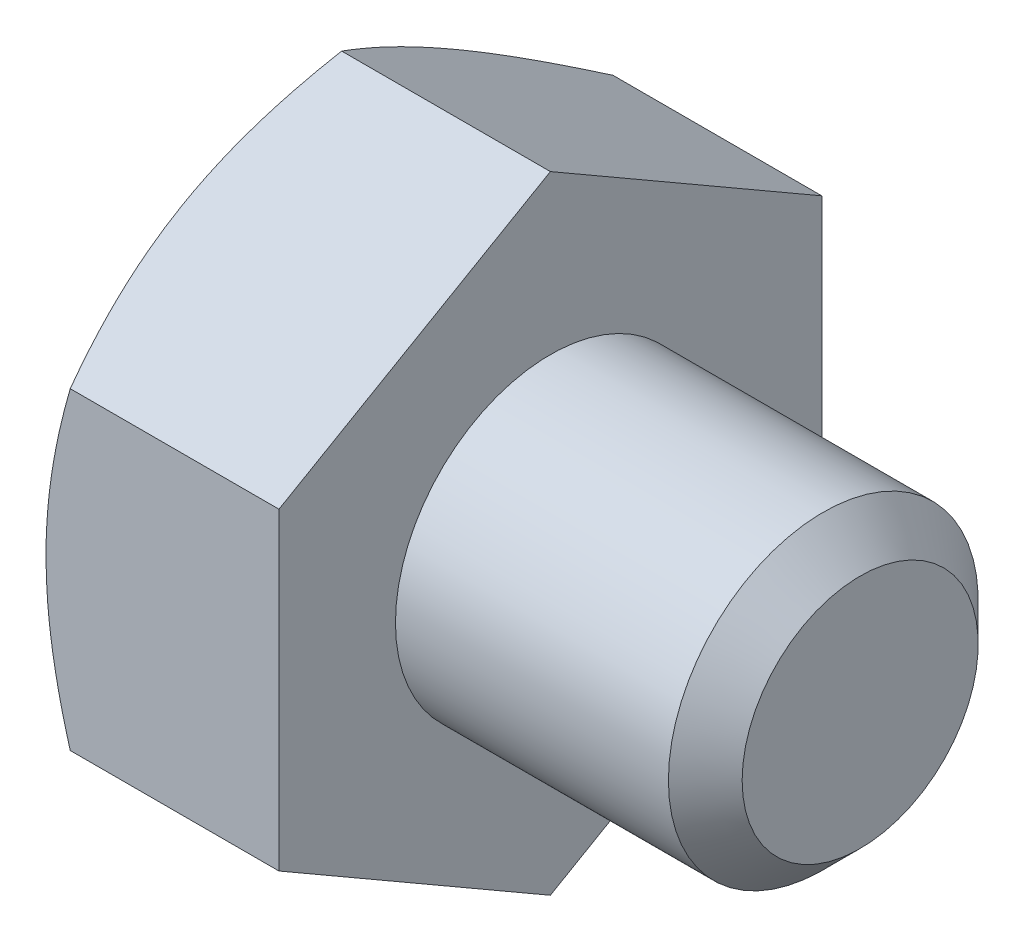
ISO-10303-21;
HEADER;
FILE_DESCRIPTION(('STEP AP214'),'2;1');
FILE_NAME('part.step','',(''),(''),'','','');
FILE_SCHEMA(('AUTOMOTIVE_DESIGN { 1 0 10303 214 1 1 1 1 }'));
ENDSEC;
DATA;
#1=APPLICATION_CONTEXT('core data for automotive mechanical design processes');
#2=APPLICATION_PROTOCOL_DEFINITION('international standard','automotive_design',2000,#1);
#3=PRODUCT_CONTEXT('',#1,'mechanical');
#4=PRODUCT('Part','Part','',(#3));
#5=PRODUCT_RELATED_PRODUCT_CATEGORY('part','',(#4));
#6=PRODUCT_DEFINITION_FORMATION('','',#4);
#7=PRODUCT_DEFINITION_CONTEXT('part definition',#1,'design');
#8=PRODUCT_DEFINITION('design','',#6,#7);
#9=PRODUCT_DEFINITION_SHAPE('','',#8);
#10=(LENGTH_UNIT() NAMED_UNIT(*) SI_UNIT(.MILLI.,.METRE.));
#11=(NAMED_UNIT(*) PLANE_ANGLE_UNIT() SI_UNIT($,.RADIAN.));
#12=(NAMED_UNIT(*) SI_UNIT($,.STERADIAN.) SOLID_ANGLE_UNIT());
#13=UNCERTAINTY_MEASURE_WITH_UNIT(LENGTH_MEASURE(1.E-05),#10,'distance_accuracy_value','');
#14=(GEOMETRIC_REPRESENTATION_CONTEXT(3) GLOBAL_UNCERTAINTY_ASSIGNED_CONTEXT((#13)) GLOBAL_UNIT_ASSIGNED_CONTEXT((#10,
#11,#12)) REPRESENTATION_CONTEXT('',''));
#15=CARTESIAN_POINT('',(0.,0.,0.));
#16=DIRECTION('',(0.,0.,1.));
#17=DIRECTION('',(1.,0.,0.));
#18=AXIS2_PLACEMENT_3D('',#15,#16,#17);
#19=CARTESIAN_POINT('',(4.7752,3.21156860739421,-5.5626));
#20=DIRECTION('',(0.,-0.866025403784438,0.500000000000001));
#21=DIRECTION('',(0.,-0.500000000000001,-0.866025403784438));
#22=AXIS2_PLACEMENT_3D('',#19,#20,#21);
#23=PLANE('',#22);
#24=CARTESIAN_POINT('',(0.496898061070138,6.42325268484227,0.0002));
#25=CARTESIAN_POINT('',(0.456146202255126,6.35265858120791,-0.122072574209491));
#26=CARTESIAN_POINT('',(0.417243775308719,6.2818012683745,-0.244801040124762));
#27=CARTESIAN_POINT('',(0.34364716156054,6.13951120287093,-0.491254662989243));
#28=CARTESIAN_POINT('',(0.308954790139042,6.06807821602766,-0.614980225538197));
#29=CARTESIAN_POINT('',(0.211873701066854,5.8526355064814,-0.988137944592619));
#30=CARTESIAN_POINT('',(0.156654841923372,5.70777535201369,-1.23904309212296));
#31=CARTESIAN_POINT('',(0.0919037861815281,5.49099476252076,-1.61451808721945));
#32=CARTESIAN_POINT('',(0.0734579983429344,5.419722058732,-1.73796603137439));
#33=CARTESIAN_POINT('',(0.0425268916674626,5.27685459691414,-1.98541973399132));
#34=CARTESIAN_POINT('',(0.0300410461890087,5.20525986790489,-2.10942544218948));
#35=CARTESIAN_POINT('',(0.0113480299394713,5.06194605565758,-2.35765224642821));
#36=CARTESIAN_POINT('',(0.00513373340584784,4.9902272065059,-2.48187293701927));
#37=CARTESIAN_POINT('',(-0.000889599359094601,4.84672720555796,-2.7304222295473));
#38=CARTESIAN_POINT('',(-0.000698833448295369,4.7749460557547,-2.85475082803225));
#39=CARTESIAN_POINT('',(0.0086281013634236,4.57828637012706,-3.19537539533984));
#40=CARTESIAN_POINT('',(0.0242873955350763,4.45347220138351,-3.41155987710816));
#41=CARTESIAN_POINT('',(0.0739443233816051,4.20467287416474,-3.84249295274001));
#42=CARTESIAN_POINT('',(0.107958931423457,4.08068859075412,-4.05724003094722));
#43=CARTESIAN_POINT('',(0.192986041409675,3.83138850679899,-4.4890404426887));
#44=CARTESIAN_POINT('',(0.2443588139374,3.70610416511177,-4.70603928788379));
#45=CARTESIAN_POINT('',(0.360954456999591,3.45740388365365,-5.13680081122591));
#46=CARTESIAN_POINT('',(0.426149937617056,3.33398475856357,-5.35056900650764));
#47=CARTESIAN_POINT('',(0.496898061070134,3.21145313734037,-5.5628));
#48=B_SPLINE_CURVE_WITH_KNOTS('',3,(#24,#25,#26,#27,#28,#29,#30,#31,#32,#33,#34,#35,#36,#37,#38,
#39,#40,#41,#42,#43,#44,#45,#46,#47),.UNSPECIFIED.,.F.,.F.,(4,2,2,2,2,2,2,2,2,2,2,4),(0.,
0.440820118562269,0.881829648847397,1.76568130465016,2.19678242164486,2.62784543796582,
3.05841812523867,3.48897751176352,4.23854798324166,4.98881282275669,5.75571809391027,
6.52111769989992),.UNSPECIFIED.);
#49=CARTESIAN_POINT('',(0.496831392605784,6.42313721478843,0.));
#50=VERTEX_POINT('',#49);
#51=CARTESIAN_POINT('',(0.,4.81735291109132,-2.7813));
#52=VERTEX_POINT('',#51);
#53=EDGE_CURVE('E49',#50,#52,#48,.T.);
#54=ORIENTED_EDGE('',*,*,#53,.F.);
#55=DIRECTION('',(-1.,0.,0.));
#56=VECTOR('',#55,1.);
#57=CARTESIAN_POINT('',(4.7752,6.42313721478843,0.));
#58=LINE('',#57,#56);
#59=CARTESIAN_POINT('',(4.7752,6.42313721478843,0.));
#60=VERTEX_POINT('',#59);
#61=EDGE_CURVE('E145',#60,#50,#58,.T.);
#62=ORIENTED_EDGE('',*,*,#61,.F.);
#63=DIRECTION('',(0.,0.500000000000001,0.866025403784438));
#64=VECTOR('',#63,1.);
#65=CARTESIAN_POINT('',(4.7752,3.21156860739421,-5.5626));
#66=LINE('',#65,#64);
#67=CARTESIAN_POINT('',(4.7752,3.21156860739421,-5.5626));
#68=VERTEX_POINT('',#67);
#69=EDGE_CURVE('E230',#68,#60,#66,.T.);
#70=ORIENTED_EDGE('',*,*,#69,.F.);
#71=DIRECTION('',(-1.,0.,0.));
#72=VECTOR('',#71,1.);
#73=CARTESIAN_POINT('',(4.7752,3.21156860739421,-5.5626));
#74=LINE('',#73,#72);
#75=CARTESIAN_POINT('',(0.49683139260578,3.21156860739421,-5.5626));
#76=VERTEX_POINT('',#75);
#77=EDGE_CURVE('E133',#68,#76,#74,.T.);
#78=ORIENTED_EDGE('',*,*,#77,.T.);
#79=EDGE_CURVE('E127',#52,#76,#48,.T.);
#80=ORIENTED_EDGE('',*,*,#79,.F.);
#81=EDGE_LOOP('',(#54,#62,#70,#78,#80));
#82=FACE_BOUND('',#81,.T.);
#83=ADVANCED_FACE('F33',(#82),#23,.F.);
#84=CARTESIAN_POINT('',(4.7752,6.42313721478843,0.));
#85=DIRECTION('',(0.,-0.866025403784438,-0.500000000000001));
#86=DIRECTION('',(0.,0.500000000000001,-0.866025403784438));
#87=AXIS2_PLACEMENT_3D('',#84,#85,#86);
#88=PLANE('',#87);
#89=CARTESIAN_POINT('',(0.496898061070133,3.21145313734037,5.5628));
#90=CARTESIAN_POINT('',(0.456146202255121,3.28204724097473,5.44052742579051));
#91=CARTESIAN_POINT('',(0.417243775308715,3.35290455380814,5.31779895987524));
#92=CARTESIAN_POINT('',(0.343647161560535,3.49519461931171,5.07134533701076));
#93=CARTESIAN_POINT('',(0.308954790139037,3.56662760615499,4.9476197744618));
#94=CARTESIAN_POINT('',(0.211873701066849,3.78207031570124,4.57446205540738));
#95=CARTESIAN_POINT('',(0.156654841923369,3.92693047016895,4.32355690787704));
#96=CARTESIAN_POINT('',(0.0919037861815254,4.14371105966188,3.94808191278055));
#97=CARTESIAN_POINT('',(0.0734579983429319,4.21498376345064,3.82463396862561));
#98=CARTESIAN_POINT('',(0.0425268916674609,4.35785122526849,3.57718026600868));
#99=CARTESIAN_POINT('',(0.0300410461890074,4.42944595427775,3.45317455781052));
#100=CARTESIAN_POINT('',(0.0113480299394704,4.57275976652506,3.20494775357179));
#101=CARTESIAN_POINT('',(0.00513373340584673,4.64447861567674,3.08072706298073));
#102=CARTESIAN_POINT('',(-0.000889599359095481,4.78797861662468,2.8321777704527));
#103=CARTESIAN_POINT('',(-0.000698833448295902,4.85975976642794,2.70784917196775));
#104=CARTESIAN_POINT('',(0.00862810136342389,5.05641945205558,2.36722460466016));
#105=CARTESIAN_POINT('',(0.024287395535077,5.18123362079913,2.15104012289184));
#106=CARTESIAN_POINT('',(0.0739443233816064,5.4300329480179,1.72010704725999));
#107=CARTESIAN_POINT('',(0.107958931423459,5.55401723142852,1.50535996905278));
#108=CARTESIAN_POINT('',(0.192986041409678,5.80331731538365,1.07355955731131));
#109=CARTESIAN_POINT('',(0.244358813937402,5.92860165707088,0.856560712116215));
#110=CARTESIAN_POINT('',(0.360954456999595,6.17730193852899,0.425799188774085));
#111=CARTESIAN_POINT('',(0.42614993761706,6.30072106361907,0.212030993492364));
#112=CARTESIAN_POINT('',(0.496898061070138,6.42325268484227,-0.000199999999999655));
#113=B_SPLINE_CURVE_WITH_KNOTS('',3,(#89,#90,#91,#92,#93,#94,#95,#96,#97,#98,#99,#100,#101,#102,
#103,#104,#105,#106,#107,#108,#109,#110,#111,#112),.UNSPECIFIED.,.F.,.F.,(4,2,2,2,2,2,2,2,2,2,2,
4),(0.,0.44082011856227,0.881829648847399,1.76568130465016,2.19678242164486,2.62784543796582,
3.05841812523867,3.48897751176352,4.23854798324165,4.98881282275669,5.75571809391027,
6.52111769989992),.UNSPECIFIED.);
#114=CARTESIAN_POINT('',(0.496831392605779,3.21156860739421,5.5626));
#115=VERTEX_POINT('',#114);
#116=CARTESIAN_POINT('',(0.,4.81735291109131,2.78130000000001));
#117=VERTEX_POINT('',#116);
#118=EDGE_CURVE('E56',#115,#117,#113,.T.);
#119=ORIENTED_EDGE('',*,*,#118,.F.);
#120=DIRECTION('',(-1.,0.,0.));
#121=VECTOR('',#120,1.);
#122=CARTESIAN_POINT('',(4.7752,3.21156860739421,5.5626));
#123=LINE('',#122,#121);
#124=CARTESIAN_POINT('',(4.7752,3.21156860739421,5.5626));
#125=VERTEX_POINT('',#124);
#126=EDGE_CURVE('E143',#125,#115,#123,.T.);
#127=ORIENTED_EDGE('',*,*,#126,.F.);
#128=DIRECTION('',(0.,-0.500000000000001,0.866025403784438));
#129=VECTOR('',#128,1.);
#130=CARTESIAN_POINT('',(4.7752,6.42313721478843,0.));
#131=LINE('',#130,#129);
#132=EDGE_CURVE('E228',#60,#125,#131,.T.);
#133=ORIENTED_EDGE('',*,*,#132,.F.);
#134=ORIENTED_EDGE('',*,*,#61,.T.);
#135=EDGE_CURVE('E160',#117,#50,#113,.T.);
#136=ORIENTED_EDGE('',*,*,#135,.F.);
#137=EDGE_LOOP('',(#119,#127,#133,#134,#136));
#138=FACE_BOUND('',#137,.T.);
#139=ADVANCED_FACE('F166',(#138),#88,.F.);
#140=CARTESIAN_POINT('',(4.7752,3.21156860739421,5.5626));
#141=DIRECTION('',(0.,0.,-1.));
#142=DIRECTION('',(-1.,0.,0.));
#143=AXIS2_PLACEMENT_3D('',#140,#141,#142);
#144=PLANE('',#143);
#145=CARTESIAN_POINT('',(2.76946298118781,-8.73931907134929,5.5626));
#146=CARTESIAN_POINT('',(2.6506747768731,-8.49536496294498,5.5626));
#147=CARTESIAN_POINT('',(2.53299354297042,-8.25086273134794,5.5626));
#148=CARTESIAN_POINT('',(2.30046552320842,-7.76047089715343,5.5626));
#149=CARTESIAN_POINT('',(2.18561916316986,-7.51458109286491,5.5626));
#150=CARTESIAN_POINT('',(1.95882765602868,-7.0199096759101,5.5626));
#151=CARTESIAN_POINT('',(1.8469007539214,-6.77111967039449,5.5626));
#152=CARTESIAN_POINT('',(1.62748022369642,-6.27159952720683,5.5626));
#153=CARTESIAN_POINT('',(1.51998639326665,-6.02086947869409,5.5626));
#154=CARTESIAN_POINT('',(1.30708686305048,-5.50862062515997,5.5626));
#155=CARTESIAN_POINT('',(1.2018721345633,-5.24702202730587,5.5626));
#156=CARTESIAN_POINT('',(0.999136458565239,-4.72080610690398,5.5626));
#157=CARTESIAN_POINT('',(0.901616358276672,-4.45618845560254,5.5626));
#158=CARTESIAN_POINT('',(0.716747076854939,-3.92397402586809,5.5626));
#159=CARTESIAN_POINT('',(0.629378259627778,-3.65638413416907,5.5626));
#160=CARTESIAN_POINT('',(0.467540995367504,-3.11736467394694,5.5626));
#161=CARTESIAN_POINT('',(0.393068603844486,-2.84593630702826,5.5626));
#162=CARTESIAN_POINT('',(0.260913640576689,-2.30059524037531,5.5626));
#163=CARTESIAN_POINT('',(0.203137923933971,-2.02670547196031,5.5626));
#164=CARTESIAN_POINT('',(0.107584140993964,-1.47536640605576,5.5626));
#165=CARTESIAN_POINT('',(0.0698039298235428,-1.19791749361911,5.5626));
#166=CARTESIAN_POINT('',(0.030632903312984,-0.782024037078673,5.5626));
#167=CARTESIAN_POINT('',(0.020503324437069,-0.64436960351792,5.5626));
#168=CARTESIAN_POINT('',(0.00607539249484237,-0.368760084714119,5.5626));
#169=CARTESIAN_POINT('',(0.00177648780683689,-0.230805029149004,5.5626));
#170=CARTESIAN_POINT('',(-0.000882415988903131,0.0451740110860284,5.5626));
#171=CARTESIAN_POINT('',(0.000758104200528362,0.183198000728084,5.5626));
#172=CARTESIAN_POINT('',(0.00993570123351356,0.459040077970887,5.5626));
#173=CARTESIAN_POINT('',(0.0174725517322403,0.596858173271922,5.5626));
#174=CARTESIAN_POINT('',(0.042250522694167,0.924672766545129,5.5626));
#175=CARTESIAN_POINT('',(0.0620998981240935,1.11447655015,5.5626));
#176=CARTESIAN_POINT('',(0.111925243451358,1.49274005777642,5.5626));
#177=CARTESIAN_POINT('',(0.141902492996068,1.68119960888144,5.5626));
#178=CARTESIAN_POINT('',(0.245441794558731,2.24430469004823,5.5626));
#179=CARTESIAN_POINT('',(0.332595181454095,2.61648783903803,5.5626));
#180=CARTESIAN_POINT('',(0.484580656688794,3.17327423069249,5.5626));
#181=CARTESIAN_POINT('',(0.539535147458606,3.36074033845108,5.5626));
#182=CARTESIAN_POINT('',(0.655361856953684,3.73385345225387,5.5626));
#183=CARTESIAN_POINT('',(0.7162341206874,3.91950044445069,5.5626));
#184=CARTESIAN_POINT('',(0.842902268347429,4.28903173945153,5.5626));
#185=CARTESIAN_POINT('',(0.90869673318839,4.47291653318727,5.5626));
#186=CARTESIAN_POINT('',(1.04441413237549,4.83914664715105,5.5626));
#187=CARTESIAN_POINT('',(1.11433697604311,5.0214920010919,5.5626));
#188=CARTESIAN_POINT('',(1.30616254116173,5.50788799936832,5.5626));
#189=CARTESIAN_POINT('',(1.43118964217263,5.81070521732179,5.5626));
#190=CARTESIAN_POINT('',(1.68847909791362,6.41326146392029,5.5626));
#191=CARTESIAN_POINT('',(1.82074222334613,6.71300016062082,5.5626));
#192=CARTESIAN_POINT('',(2.09080854329268,7.31009692856946,5.5626));
#193=CARTESIAN_POINT('',(2.22861377416228,7.60745407573437,5.5626));
#194=CARTESIAN_POINT('',(2.50845292532566,8.20015103027088,5.5626));
#195=CARTESIAN_POINT('',(2.65048668069893,8.49549091576862,5.5626));
#196=CARTESIAN_POINT('',(2.9380944105176,9.08501121024945,5.5626));
#197=CARTESIAN_POINT('',(3.08367358024024,9.3791890794754,5.5626));
#198=CARTESIAN_POINT('',(3.37748078740478,9.96621951539329,5.5626));
#199=CARTESIAN_POINT('',(3.5257088459301,10.2590720715134,5.5626));
#200=CARTESIAN_POINT('',(3.9734997773906,11.135883002068,5.5626));
#201=CARTESIAN_POINT('',(4.27623214013077,11.7182219913802,5.5626));
#202=CARTESIAN_POINT('',(4.85550678061971,12.8193647778853,5.5626));
#203=CARTESIAN_POINT('',(5.13148986685698,13.3384641726992,5.5626));
#204=CARTESIAN_POINT('',(5.68680572725546,14.3749069841369,5.5626));
#205=CARTESIAN_POINT('',(5.96613869990829,14.8922502943534,5.5626));
#206=CARTESIAN_POINT('',(6.52636532569113,15.9238879354023,5.5626));
#207=CARTESIAN_POINT('',(6.80725082971981,16.438186698545,5.5626));
#208=CARTESIAN_POINT('',(7.37092859091898,17.465687215985,5.5626));
#209=CARTESIAN_POINT('',(7.65372069975332,17.9788890516248,5.5626));
#210=CARTESIAN_POINT('',(7.9372077944748,18.4917042756102,5.5626));
#211=B_SPLINE_CURVE_WITH_KNOTS('',3,(#145,#146,#147,#148,#149,#150,#151,#152,#153,#154,#155,
#156,#157,#158,#159,#160,#161,#162,#163,#164,#165,#166,#167,#168,#169,#170,#171,#172,#173,#174,
#175,#176,#177,#178,#179,#180,#181,#182,#183,#184,#185,#186,#187,#188,#189,#190,#191,#192,#193,
#194,#195,#196,#197,#198,#199,#200,#201,#202,#203,#204,#205,#206,#207,#208,#209,#210),
.UNSPECIFIED.,.F.,.F.,(4,2,2,2,2,2,2,2,2,2,2,2,2,2,2,2,2,2,2,2,2,2,2,2,2,2,2,2,2,2,2,2,4),(0.,
0.814023059457575,1.62816765666496,2.44655638570204,3.26490772451191,4.1107076400708,
4.95660055342857,5.80082897227975,6.64479871831149,7.4839651145243,8.32304147698214,
8.73701667946676,9.15095271433074,9.56492494141957,9.97888127796806,10.5510771655991,
11.1233453766966,12.2684477407956,12.8544603586944,13.4404774339429,14.0263262050102,
14.6121621128824,15.5948602729039,16.577663303757,17.5608308091096,18.5439600191607,
19.52862868616,20.5133051939663,22.4822323595087,24.2459312012704,26.0097350693917,
27.7677407284946,29.5256111556825),.UNSPECIFIED.);
#212=CARTESIAN_POINT('',(0.49683139260578,-3.21156860739421,5.5626));
#213=VERTEX_POINT('',#212);
#214=CARTESIAN_POINT('',(0.,0.,5.5626));
#215=VERTEX_POINT('',#214);
#216=EDGE_CURVE('E240',#213,#215,#211,.T.);
#217=ORIENTED_EDGE('',*,*,#216,.F.);
#218=DIRECTION('',(-1.,0.,0.));
#219=VECTOR('',#218,1.);
#220=CARTESIAN_POINT('',(4.7752,-3.21156860739421,5.5626));
#221=LINE('',#220,#219);
#222=CARTESIAN_POINT('',(4.7752,-3.21156860739421,5.5626));
#223=VERTEX_POINT('',#222);
#224=EDGE_CURVE('E135',#223,#213,#221,.T.);
#225=ORIENTED_EDGE('',*,*,#224,.F.);
#226=DIRECTION('',(0.,-1.,0.));
#227=VECTOR('',#226,1.);
#228=CARTESIAN_POINT('',(4.7752,3.21156860739421,5.5626));
#229=LINE('',#228,#227);
#230=EDGE_CURVE('E224',#125,#223,#229,.T.);
#231=ORIENTED_EDGE('',*,*,#230,.F.);
#232=ORIENTED_EDGE('',*,*,#126,.T.);
#233=EDGE_CURVE('E182',#215,#115,#211,.T.);
#234=ORIENTED_EDGE('',*,*,#233,.F.);
#235=EDGE_LOOP('',(#217,#225,#231,#232,#234));
#236=FACE_BOUND('',#235,.T.);
#237=ADVANCED_FACE('F246',(#236),#144,.F.);
#238=CARTESIAN_POINT('',(4.7752,-6.42313721478843,0.));
#239=DIRECTION('',(0.,0.866025403784438,-0.500000000000001));
#240=DIRECTION('',(0.,0.500000000000001,0.866025403784438));
#241=AXIS2_PLACEMENT_3D('',#238,#239,#240);
#242=PLANE('',#241);
#243=CARTESIAN_POINT('',(0.496898061070139,-6.42325268484227,-0.000200000000000758));
#244=CARTESIAN_POINT('',(0.456146202255127,-6.35265858120791,0.12207257420949));
#245=CARTESIAN_POINT('',(0.417243775308719,-6.2818012683745,0.244801040124761));
#246=CARTESIAN_POINT('',(0.34364716156054,-6.13951120287093,0.491254662989243));
#247=CARTESIAN_POINT('',(0.308954790139042,-6.06807821602766,0.614980225538196));
#248=CARTESIAN_POINT('',(0.211873701066853,-5.8526355064814,0.988137944592619));
#249=CARTESIAN_POINT('',(0.156654841923372,-5.70777535201369,1.23904309212296));
#250=CARTESIAN_POINT('',(0.091903786181528,-5.49099476252076,1.61451808721945));
#251=CARTESIAN_POINT('',(0.0734579983429343,-5.419722058732,1.73796603137439));
#252=CARTESIAN_POINT('',(0.0425268916674627,-5.27685459691414,1.98541973399132));
#253=CARTESIAN_POINT('',(0.030041046189009,-5.20525986790489,2.10942544218948));
#254=CARTESIAN_POINT('',(0.0113480299394717,-5.06194605565758,2.35765224642821));
#255=CARTESIAN_POINT('',(0.00513373340584793,-4.9902272065059,2.48187293701927));
#256=CARTESIAN_POINT('',(-0.000889599359094676,-4.84672720555796,2.7304222295473));
#257=CARTESIAN_POINT('',(-0.000698833448295408,-4.7749460557547,2.85475082803225));
#258=CARTESIAN_POINT('',(0.0086281013634237,-4.57828637012706,3.19537539533984));
#259=CARTESIAN_POINT('',(0.0242873955350766,-4.4534722013835,3.41155987710816));
#260=CARTESIAN_POINT('',(0.0739443233816055,-4.20467287416474,3.84249295274001));
#261=CARTESIAN_POINT('',(0.107958931423457,-4.08068859075412,4.05724003094723));
#262=CARTESIAN_POINT('',(0.192986041409675,-3.83138850679899,4.48904044268869));
#263=CARTESIAN_POINT('',(0.244358813937399,-3.70610416511177,4.70603928788378));
#264=CARTESIAN_POINT('',(0.360954456999591,-3.45740388365365,5.13680081122591));
#265=CARTESIAN_POINT('',(0.426149937617056,-3.33398475856357,5.35056900650764));
#266=CARTESIAN_POINT('',(0.496898061070134,-3.21145313734037,5.5628));
#267=B_SPLINE_CURVE_WITH_KNOTS('',3,(#243,#244,#245,#246,#247,#248,#249,#250,#251,#252,#253,
#254,#255,#256,#257,#258,#259,#260,#261,#262,#263,#264,#265,#266),.UNSPECIFIED.,.F.,.F.,(4,2,2,
2,2,2,2,2,2,2,2,4),(0.,0.44082011856227,0.881829648847399,1.76568130465016,2.19678242164486,
2.62784543796583,3.05841812523868,3.48897751176352,4.23854798324166,4.98881282275669,
5.75571809391027,6.52111769989992),.UNSPECIFIED.);
#268=CARTESIAN_POINT('',(0.496831392605784,-6.42313721478843,0.));
#269=VERTEX_POINT('',#268);
#270=CARTESIAN_POINT('',(0.,-4.81735291109132,2.7813));
#271=VERTEX_POINT('',#270);
#272=EDGE_CURVE('E168',#269,#271,#267,.T.);
#273=ORIENTED_EDGE('',*,*,#272,.F.);
#274=DIRECTION('',(-1.,0.,0.));
#275=VECTOR('',#274,1.);
#276=CARTESIAN_POINT('',(4.7752,-6.42313721478843,0.));
#277=LINE('',#276,#275);
#278=CARTESIAN_POINT('',(4.7752,-6.42313721478843,0.));
#279=VERTEX_POINT('',#278);
#280=EDGE_CURVE('E132',#279,#269,#277,.T.);
#281=ORIENTED_EDGE('',*,*,#280,.F.);
#282=DIRECTION('',(0.,-0.500000000000001,-0.866025403784438));
#283=VECTOR('',#282,1.);
#284=CARTESIAN_POINT('',(4.7752,-6.42313721478843,0.));
#285=LINE('',#284,#283);
#286=EDGE_CURVE('E222',#223,#279,#285,.T.);
#287=ORIENTED_EDGE('',*,*,#286,.F.);
#288=ORIENTED_EDGE('',*,*,#224,.T.);
#289=EDGE_CURVE('E170',#271,#213,#267,.T.);
#290=ORIENTED_EDGE('',*,*,#289,.F.);
#291=EDGE_LOOP('',(#273,#281,#287,#288,#290));
#292=FACE_BOUND('',#291,.T.);
#293=ADVANCED_FACE('F218',(#292),#242,.F.);
#294=CARTESIAN_POINT('',(4.7752,-3.21156860739422,-5.5626));
#295=DIRECTION('',(0.,0.866025403784439,0.5));
#296=DIRECTION('',(0.,-0.5,0.866025403784439));
#297=AXIS2_PLACEMENT_3D('',#294,#295,#296);
#298=PLANE('',#297);
#299=CARTESIAN_POINT('',(0.496898061070137,-3.21145313734038,-5.5628));
#300=CARTESIAN_POINT('',(0.456146202255125,-3.28204724097474,-5.44052742579051));
#301=CARTESIAN_POINT('',(0.417243775308718,-3.35290455380815,-5.31779895987524));
#302=CARTESIAN_POINT('',(0.343647161560539,-3.49519461931172,-5.07134533701076));
#303=CARTESIAN_POINT('',(0.308954790139041,-3.56662760615499,-4.94761977446181));
#304=CARTESIAN_POINT('',(0.211873701066853,-3.78207031570125,-4.57446205540738));
#305=CARTESIAN_POINT('',(0.156654841923372,-3.92693047016895,-4.32355690787704));
#306=CARTESIAN_POINT('',(0.0919037861815286,-4.14371105966189,-3.94808191278055));
#307=CARTESIAN_POINT('',(0.0734579983429348,-4.21498376345065,-3.82463396862561));
#308=CARTESIAN_POINT('',(0.0425268916674632,-4.3578512252685,-3.57718026600868));
#309=CARTESIAN_POINT('',(0.0300410461890097,-4.42944595427776,-3.45317455781052));
#310=CARTESIAN_POINT('',(0.0113480299394728,-4.57275976652507,-3.20494775357179));
#311=CARTESIAN_POINT('',(0.00513373340584938,-4.64447861567674,-3.08072706298073));
#312=CARTESIAN_POINT('',(-0.000889599359092633,-4.78797861662469,-2.8321777704527));
#313=CARTESIAN_POINT('',(-0.000698833448293064,-4.85975976642794,-2.70784917196775));
#314=CARTESIAN_POINT('',(0.00862810136342647,-5.05641945205558,-2.36722460466016));
#315=CARTESIAN_POINT('',(0.0242873955350791,-5.18123362079914,-2.15104012289184));
#316=CARTESIAN_POINT('',(0.073944323381608,-5.4300329480179,-1.72010704725999));
#317=CARTESIAN_POINT('',(0.10795893142346,-5.55401723142852,-1.50535996905278));
#318=CARTESIAN_POINT('',(0.192986041409679,-5.80331731538365,-1.07355955731131));
#319=CARTESIAN_POINT('',(0.244358813937403,-5.92860165707088,-0.856560712116215));
#320=CARTESIAN_POINT('',(0.360954456999596,-6.17730193852899,-0.425799188774086));
#321=CARTESIAN_POINT('',(0.42614993761706,-6.30072106361907,-0.212030993492365));
#322=CARTESIAN_POINT('',(0.496898061070139,-6.42325268484227,0.000199999999999579));
#323=B_SPLINE_CURVE_WITH_KNOTS('',3,(#299,#300,#301,#302,#303,#304,#305,#306,#307,#308,#309,
#310,#311,#312,#313,#314,#315,#316,#317,#318,#319,#320,#321,#322),.UNSPECIFIED.,.F.,.F.,(4,2,2,
2,2,2,2,2,2,2,2,4),(0.,0.440820118562269,0.881829648847398,1.76568130465016,2.19678242164486,
2.62784543796582,3.05841812523867,3.48897751176352,4.23854798324166,4.98881282275669,
5.75571809391027,6.52111769989992),.UNSPECIFIED.);
#324=CARTESIAN_POINT('',(0.496831392605574,-3.21156860739453,-5.5626));
#325=VERTEX_POINT('',#324);
#326=CARTESIAN_POINT('',(0.,-4.81735291109132,-2.7813));
#327=VERTEX_POINT('',#326);
#328=EDGE_CURVE('E109',#325,#327,#323,.T.);
#329=ORIENTED_EDGE('',*,*,#328,.F.);
#330=DIRECTION('',(-1.,0.,0.));
#331=VECTOR('',#330,1.);
#332=CARTESIAN_POINT('',(4.7752,-3.21156860739422,-5.5626));
#333=LINE('',#332,#331);
#334=CARTESIAN_POINT('',(4.7752,-3.21156860739422,-5.5626));
#335=VERTEX_POINT('',#334);
#336=EDGE_CURVE('E123',#335,#325,#333,.T.);
#337=ORIENTED_EDGE('',*,*,#336,.F.);
#338=DIRECTION('',(0.,0.5,-0.866025403784438));
#339=VECTOR('',#338,1.);
#340=CARTESIAN_POINT('',(4.7752,-3.21156860739422,-5.5626));
#341=LINE('',#340,#339);
#342=EDGE_CURVE('E220',#279,#335,#341,.T.);
#343=ORIENTED_EDGE('',*,*,#342,.F.);
#344=ORIENTED_EDGE('',*,*,#280,.T.);
#345=EDGE_CURVE('E126',#327,#269,#323,.T.);
#346=ORIENTED_EDGE('',*,*,#345,.F.);
#347=EDGE_LOOP('',(#329,#337,#343,#344,#346));
#348=FACE_BOUND('',#347,.T.);
#349=ADVANCED_FACE('F121',(#348),#298,.F.);
#350=CARTESIAN_POINT('',(4.7752,3.21156860739421,-5.5626));
#351=DIRECTION('',(0.,0.,1.));
#352=DIRECTION('',(0.,-1.,0.));
#353=AXIS2_PLACEMENT_3D('',#350,#351,#352);
#354=PLANE('',#353);
#355=CARTESIAN_POINT('',(2.76946298300577,-8.73931907508182,-5.5626));
#356=CARTESIAN_POINT('',(2.65067477861526,-8.49536496655187,-5.5626));
#357=CARTESIAN_POINT('',(2.53299354463681,-8.25086273482909,-5.5626));
#358=CARTESIAN_POINT('',(2.30046552472366,-7.76047090038273,-5.5626));
#359=CARTESIAN_POINT('',(2.18561916460971,-7.51458109596809,-5.5626));
#360=CARTESIAN_POINT('',(1.9588276573177,-7.01990967875913,-5.5626));
#361=CARTESIAN_POINT('',(1.84690075513499,-6.77111967311548,-5.5626));
#362=CARTESIAN_POINT('',(1.62748022476041,-6.27159952967088,-5.5626));
#363=CARTESIAN_POINT('',(1.51998639425646,-6.02086948102925,-5.5626));
#364=CARTESIAN_POINT('',(1.30708686388974,-5.50862062722724,-5.5626));
#365=CARTESIAN_POINT('',(1.20187213532634,-5.24702202923405,-5.5626));
#366=CARTESIAN_POINT('',(0.999136459179913,-4.72080610855179,-5.5626));
#367=CARTESIAN_POINT('',(0.901616358819185,-4.45618845710904,-5.5626));
#368=CARTESIAN_POINT('',(0.716747077259984,-3.92397402708937,-5.5626));
#369=CARTESIAN_POINT('',(0.629378259967497,-3.65638413524644,-5.5626));
#370=CARTESIAN_POINT('',(0.467540995587164,-3.11736467473259,-5.5626));
#371=CARTESIAN_POINT('',(0.393068604009406,-2.84593630766609,-5.5626));
#372=CARTESIAN_POINT('',(0.26091364063106,-2.3005952406421,-5.5626));
#373=CARTESIAN_POINT('',(0.203137923936714,-2.02670547200285,-5.5626));
#374=CARTESIAN_POINT('',(0.107584140927261,-1.47536640564425,-5.5626));
#375=CARTESIAN_POINT('',(0.0698039297389962,-1.19791749297779,-5.5626));
#376=CARTESIAN_POINT('',(0.0306329032322223,-0.782024036094228,-5.5626));
#377=CARTESIAN_POINT('',(0.0205033243625265,-0.644369602420759,-5.5626));
#378=CARTESIAN_POINT('',(0.00607539244269951,-0.368760083391738,-5.5626));
#379=CARTESIAN_POINT('',(0.00177648777087276,-0.23080502771412,-5.5626));
#380=CARTESIAN_POINT('',(-0.000882415982738227,0.0451740127451194,-5.5626));
#381=CARTESIAN_POINT('',(0.0007581042326469,0.183198002498877,-5.5626));
#382=CARTESIAN_POINT('',(0.0099357013266242,0.459040079963613,-5.5626));
#383=CARTESIAN_POINT('',(0.0174725518603888,0.596858175374879,-5.5626));
#384=CARTESIAN_POINT('',(0.0422505229084567,0.924672768817531,-5.5626));
#385=CARTESIAN_POINT('',(0.0620998983879047,1.11447655248113,-5.5626));
#386=CARTESIAN_POINT('',(0.11192524381685,1.49274006022233,-5.5626));
#387=CARTESIAN_POINT('',(0.14190249341372,1.68119961138341,-5.5626));
#388=CARTESIAN_POINT('',(0.245441795133938,2.24430469271528,-5.5626));
#389=CARTESIAN_POINT('',(0.332595182135704,2.61648784181075,-5.5626));
#390=CARTESIAN_POINT('',(0.484580657527373,3.17327423362328,-5.5626));
#391=CARTESIAN_POINT('',(0.539535148349869,3.36074034143571,-5.5626));
#392=CARTESIAN_POINT('',(0.655361857948684,3.73385345534553,-5.5626));
#393=CARTESIAN_POINT('',(0.716234121733454,3.91950044759558,-5.5626));
#394=CARTESIAN_POINT('',(0.842902269493742,4.28903174270245,-5.5626));
#395=CARTESIAN_POINT('',(0.908696734383906,4.47291653649101,-5.5626));
#396=CARTESIAN_POINT('',(1.04441413366768,4.83914665056043,-5.5626));
#397=CARTESIAN_POINT('',(1.11433697738278,5.0214920045541,-5.5626));
#398=CARTESIAN_POINT('',(1.30616254258249,5.50788800286084,-5.5626));
#399=CARTESIAN_POINT('',(1.43118964362202,5.81070522079334,-5.5626));
#400=CARTESIAN_POINT('',(1.68847909941208,6.41326146735259,-5.5626));
#401=CARTESIAN_POINT('',(1.82074222486501,6.71300016403483,-5.5626));
#402=CARTESIAN_POINT('',(2.09080854484644,7.31009693194885,-5.5626));
#403=CARTESIAN_POINT('',(2.22861377573049,7.60745407909742,-5.5626));
#404=CARTESIAN_POINT('',(2.50845292691854,8.20015103360302,-5.5626));
#405=CARTESIAN_POINT('',(2.65048668230202,8.4954909190862,-5.5626));
#406=CARTESIAN_POINT('',(2.9380944121376,9.08501121353833,-5.5626));
#407=CARTESIAN_POINT('',(3.08367358186692,9.37918908275015,-5.5626));
#408=CARTESIAN_POINT('',(3.37748078904247,9.96621951864087,-5.5626));
#409=CARTESIAN_POINT('',(3.52570884757213,10.2590720747479,-5.5626));
#410=CARTESIAN_POINT('',(3.97349977904315,11.1358830052649,-5.5626));
#411=CARTESIAN_POINT('',(4.2762321417869,11.7182219945537,-5.5626));
#412=CARTESIAN_POINT('',(4.85550678228879,12.8193647810355,-5.5626));
#413=CARTESIAN_POINT('',(5.13148986853599,13.3384641758493,-5.5626));
#414=CARTESIAN_POINT('',(5.6868057289523,14.3749069872876,-5.5626));
#415=CARTESIAN_POINT('',(5.96613870161304,14.8922502975048,-5.5626));
#416=CARTESIAN_POINT('',(6.52636532741205,15.9238879385592,-5.5626));
#417=CARTESIAN_POINT('',(6.80725083144904,16.4381867017066,-5.5626));
#418=CARTESIAN_POINT('',(7.3709285926639,17.4656872191565,-5.5626));
#419=CARTESIAN_POINT('',(7.65372070150563,17.9788890548016,-5.5626));
#420=CARTESIAN_POINT('',(7.93720779623418,18.4917042787925,-5.5626));
#421=B_SPLINE_CURVE_WITH_KNOTS('',3,(#355,#356,#357,#358,#359,#360,#361,#362,#363,#364,#365,
#366,#367,#368,#369,#370,#371,#372,#373,#374,#375,#376,#377,#378,#379,#380,#381,#382,#383,#384,
#385,#386,#387,#388,#389,#390,#391,#392,#393,#394,#395,#396,#397,#398,#399,#400,#401,#402,#403,
#404,#405,#406,#407,#408,#409,#410,#411,#412,#413,#414,#415,#416,#417,#418,#419,#420),
.UNSPECIFIED.,.F.,.F.,(4,2,2,2,2,2,2,2,2,2,2,2,2,2,2,2,2,2,2,2,2,2,2,2,2,2,2,2,2,2,2,2,4),(0.,
0.814023059896039,1.62816765754195,2.44655638702215,3.26490772627512,4.11070764230638,
4.95660055613667,5.80082897545884,6.64479872196119,7.48396511886282,8.32304148200848,
8.73701668482869,9.15095272002817,9.56492494745271,9.97888128433687,10.5510771721585,
11.1233453834466,12.2684477479277,12.854460366026,13.4404774414739,14.0263262127402,
14.6121621208114,15.5948602808078,16.5776633116357,17.5608308169621,18.5439600269871,
19.5286286939574,20.5133052017347,22.4822323672198,24.2459312089951,26.0097350771297,
27.7677407362569,29.5256111634693),.UNSPECIFIED.);
#422=CARTESIAN_POINT('',(0.,0.,-5.5626));
#423=VERTEX_POINT('',#422);
#424=EDGE_CURVE('E115',#76,#423,#421,.F.);
#425=ORIENTED_EDGE('',*,*,#424,.F.);
#426=ORIENTED_EDGE('',*,*,#77,.F.);
#427=DIRECTION('',(0.,1.,0.));
#428=VECTOR('',#427,1.);
#429=CARTESIAN_POINT('',(4.7752,3.21156860739421,-5.5626));
#430=LINE('',#429,#428);
#431=EDGE_CURVE('E131',#335,#68,#430,.T.);
#432=ORIENTED_EDGE('',*,*,#431,.F.);
#433=ORIENTED_EDGE('',*,*,#336,.T.);
#434=EDGE_CURVE('E106',#423,#325,#421,.F.);
#435=ORIENTED_EDGE('',*,*,#434,.F.);
#436=EDGE_LOOP('',(#425,#426,#432,#433,#435));
#437=FACE_BOUND('',#436,.T.);
#438=ADVANCED_FACE('F129',(#437),#354,.F.);
#439=CARTESIAN_POINT('',(4.7752,6.42313721478843,0.));
#440=DIRECTION('',(1.,0.,0.));
#441=DIRECTION('',(0.,0.,-1.));
#442=AXIS2_PLACEMENT_3D('',#439,#440,#441);
#443=PLANE('',#442);
#444=CARTESIAN_POINT('',(4.7752,0.,0.));
#445=DIRECTION('',(1.,0.,0.));
#446=DIRECTION('',(0.,0.,-1.));
#447=AXIS2_PLACEMENT_3D('',#444,#445,#446);
#448=CIRCLE('',#447,3.175);
#449=CARTESIAN_POINT('',(4.7752,0.,-3.175));
#450=VERTEX_POINT('',#449);
#451=EDGE_CURVE('E233',#450,#450,#448,.F.);
#452=ORIENTED_EDGE('',*,*,#451,.T.);
#453=EDGE_LOOP('',(#452));
#454=FACE_BOUND('',#453,.T.);
#455=ORIENTED_EDGE('',*,*,#69,.T.);
#456=ORIENTED_EDGE('',*,*,#132,.T.);
#457=ORIENTED_EDGE('',*,*,#230,.T.);
#458=ORIENTED_EDGE('',*,*,#286,.T.);
#459=ORIENTED_EDGE('',*,*,#342,.T.);
#460=ORIENTED_EDGE('',*,*,#431,.T.);
#461=EDGE_LOOP('',(#455,#456,#457,#458,#459,#460));
#462=FACE_BOUND('',#461,.T.);
#463=ADVANCED_FACE('F248',(#454,#462),#443,.T.);
#464=CARTESIAN_POINT('',(0.,0.,0.));
#465=DIRECTION('',(-1.,0.,0.));
#466=DIRECTION('',(0.,0.,1.));
#467=AXIS2_PLACEMENT_3D('',#464,#465,#466);
#468=CYLINDRICAL_SURFACE('',#467,3.175);
#469=ORIENTED_EDGE('',*,*,#451,.F.);
#470=EDGE_LOOP('',(#469));
#471=FACE_BOUND('',#470,.T.);
#472=CARTESIAN_POINT('',(10.36955,0.,0.));
#473=DIRECTION('',(-1.,0.,0.));
#474=DIRECTION('',(0.,0.,1.));
#475=AXIS2_PLACEMENT_3D('',#472,#473,#474);
#476=CIRCLE('',#475,3.175);
#477=CARTESIAN_POINT('',(10.36955,0.,3.175));
#478=VERTEX_POINT('',#477);
#479=EDGE_CURVE('E236',#478,#478,#476,.T.);
#480=ORIENTED_EDGE('',*,*,#479,.T.);
#481=EDGE_LOOP('',(#480));
#482=FACE_BOUND('',#481,.T.);
#483=ADVANCED_FACE('F279',(#471,#482),#468,.T.);
#484=CARTESIAN_POINT('',(11.1252,0.,0.));
#485=DIRECTION('',(-1.,0.,0.));
#486=DIRECTION('',(0.,0.,1.));
#487=AXIS2_PLACEMENT_3D('',#484,#485,#486);
#488=CONICAL_SURFACE('',#487,2.41935,0.785398163397443);
#489=ORIENTED_EDGE('',*,*,#479,.F.);
#490=EDGE_LOOP('',(#489));
#491=FACE_BOUND('',#490,.T.);
#492=CARTESIAN_POINT('',(11.1252,0.,0.));
#493=DIRECTION('',(-1.,0.,0.));
#494=DIRECTION('',(0.,0.,1.));
#495=AXIS2_PLACEMENT_3D('',#492,#493,#494);
#496=CIRCLE('',#495,2.41935);
#497=CARTESIAN_POINT('',(11.1252,0.,2.41935));
#498=VERTEX_POINT('',#497);
#499=EDGE_CURVE('E238',#498,#498,#496,.T.);
#500=ORIENTED_EDGE('',*,*,#499,.T.);
#501=EDGE_LOOP('',(#500));
#502=FACE_BOUND('',#501,.T.);
#503=ADVANCED_FACE('F282',(#491,#502),#488,.T.);
#504=CARTESIAN_POINT('',(11.1252,0.,0.));
#505=DIRECTION('',(-1.,0.,0.));
#506=DIRECTION('',(0.,0.,1.));
#507=AXIS2_PLACEMENT_3D('',#504,#505,#506);
#508=PLANE('',#507);
#509=ORIENTED_EDGE('',*,*,#499,.F.);
#510=EDGE_LOOP('',(#509));
#511=FACE_BOUND('',#510,.T.);
#512=ADVANCED_FACE('F195',(#511),#508,.F.);
#513=CARTESIAN_POINT('',(0.,0.,0.));
#514=DIRECTION('',(1.,0.,0.));
#515=DIRECTION('',(0.,0.,-1.));
#516=AXIS2_PLACEMENT_3D('',#513,#514,#515);
#517=CONICAL_SURFACE('',#516,5.5626,1.0471975511966);
#518=ORIENTED_EDGE('',*,*,#328,.T.);
#519=CARTESIAN_POINT('',(0.,0.,0.));
#520=DIRECTION('',(1.,0.,0.));
#521=DIRECTION('',(0.,0.,-1.));
#522=AXIS2_PLACEMENT_3D('',#519,#520,#521);
#523=CIRCLE('',#522,5.5626);
#524=EDGE_CURVE('E37',#327,#423,#523,.T.);
#525=ORIENTED_EDGE('',*,*,#524,.T.);
#526=ORIENTED_EDGE('',*,*,#434,.T.);
#527=EDGE_LOOP('',(#518,#525,#526));
#528=FACE_BOUND('',#527,.T.);
#529=ADVANCED_FACE('F108',(#528),#517,.T.);
#530=ORIENTED_EDGE('',*,*,#272,.T.);
#531=EDGE_CURVE('E150',#271,#327,#523,.T.);
#532=ORIENTED_EDGE('',*,*,#531,.T.);
#533=ORIENTED_EDGE('',*,*,#345,.T.);
#534=EDGE_LOOP('',(#530,#532,#533));
#535=FACE_BOUND('',#534,.T.);
#536=ADVANCED_FACE('F194',(#535),#517,.T.);
#537=ORIENTED_EDGE('',*,*,#216,.T.);
#538=EDGE_CURVE('E151',#215,#271,#523,.T.);
#539=ORIENTED_EDGE('',*,*,#538,.T.);
#540=ORIENTED_EDGE('',*,*,#289,.T.);
#541=EDGE_LOOP('',(#537,#539,#540));
#542=FACE_BOUND('',#541,.T.);
#543=ADVANCED_FACE('F189',(#542),#517,.T.);
#544=ORIENTED_EDGE('',*,*,#233,.T.);
#545=ORIENTED_EDGE('',*,*,#118,.T.);
#546=CARTESIAN_POINT('',(0.,0.,0.));
#547=DIRECTION('',(-1.,0.,0.));
#548=DIRECTION('',(0.,0.,1.));
#549=AXIS2_PLACEMENT_3D('',#546,#547,#548);
#550=CIRCLE('',#549,5.5626);
#551=EDGE_CURVE('E116',#215,#117,#550,.T.);
#552=ORIENTED_EDGE('',*,*,#551,.F.);
#553=EDGE_LOOP('',(#544,#545,#552));
#554=FACE_BOUND('',#553,.T.);
#555=ADVANCED_FACE('F193',(#554),#517,.T.);
#556=ORIENTED_EDGE('',*,*,#135,.T.);
#557=ORIENTED_EDGE('',*,*,#53,.T.);
#558=EDGE_CURVE('E42',#52,#117,#523,.T.);
#559=ORIENTED_EDGE('',*,*,#558,.T.);
#560=EDGE_LOOP('',(#556,#557,#559));
#561=FACE_BOUND('',#560,.T.);
#562=ADVANCED_FACE('F159',(#561),#517,.T.);
#563=ORIENTED_EDGE('',*,*,#79,.T.);
#564=ORIENTED_EDGE('',*,*,#424,.T.);
#565=EDGE_CURVE('E11',#423,#52,#523,.T.);
#566=ORIENTED_EDGE('',*,*,#565,.T.);
#567=EDGE_LOOP('',(#563,#564,#566));
#568=FACE_BOUND('',#567,.T.);
#569=ADVANCED_FACE('F251',(#568),#517,.T.);
#570=CARTESIAN_POINT('',(0.,6.42313721478843,0.));
#571=DIRECTION('',(1.,0.,0.));
#572=DIRECTION('',(0.,0.,-1.));
#573=AXIS2_PLACEMENT_3D('',#570,#571,#572);
#574=PLANE('',#573);
#575=ORIENTED_EDGE('',*,*,#565,.F.);
#576=ORIENTED_EDGE('',*,*,#524,.F.);
#577=ORIENTED_EDGE('',*,*,#531,.F.);
#578=ORIENTED_EDGE('',*,*,#538,.F.);
#579=ORIENTED_EDGE('',*,*,#551,.T.);
#580=ORIENTED_EDGE('',*,*,#558,.F.);
#581=EDGE_LOOP('',(#575,#576,#577,#578,#579,#580));
#582=FACE_BOUND('',#581,.T.);
#583=ADVANCED_FACE('F163',(#582),#574,.F.);
#584=CLOSED_SHELL('',(#83,#139,#237,#293,#349,#438,#463,#483,#503,#512,#529,#536,#543,#555,#562,
#569,#583));
#585=MANIFOLD_SOLID_BREP('B2',#584);
#586=ADVANCED_BREP_SHAPE_REPRESENTATION('',(#18,#585),#14);
#587=SHAPE_DEFINITION_REPRESENTATION(#9,#586);
ENDSEC;
END-ISO-10303-21;
